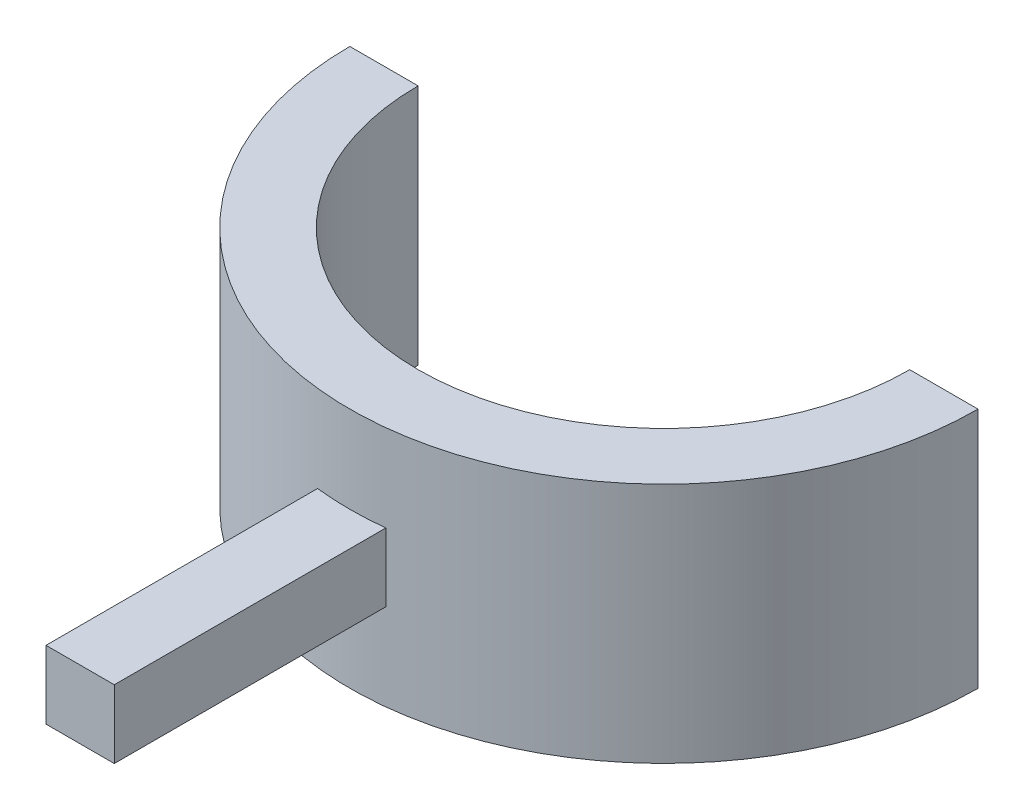
ISO-10303-21;
HEADER;
FILE_DESCRIPTION(('STEP AP214'),'2;1');
FILE_NAME('part.step','',(''),(''),'','','');
FILE_SCHEMA(('AUTOMOTIVE_DESIGN { 1 0 10303 214 1 1 1 1 }'));
ENDSEC;
DATA;
#1=APPLICATION_CONTEXT('core data for automotive mechanical design processes');
#2=APPLICATION_PROTOCOL_DEFINITION('international standard','automotive_design',2000,#1);
#3=PRODUCT_CONTEXT('',#1,'mechanical');
#4=PRODUCT('Part','Part','',(#3));
#5=PRODUCT_RELATED_PRODUCT_CATEGORY('part','',(#4));
#6=PRODUCT_DEFINITION_FORMATION('','',#4);
#7=PRODUCT_DEFINITION_CONTEXT('part definition',#1,'design');
#8=PRODUCT_DEFINITION('design','',#6,#7);
#9=PRODUCT_DEFINITION_SHAPE('','',#8);
#10=(LENGTH_UNIT() NAMED_UNIT(*) SI_UNIT(.MILLI.,.METRE.));
#11=(NAMED_UNIT(*) PLANE_ANGLE_UNIT() SI_UNIT($,.RADIAN.));
#12=(NAMED_UNIT(*) SI_UNIT($,.STERADIAN.) SOLID_ANGLE_UNIT());
#13=UNCERTAINTY_MEASURE_WITH_UNIT(LENGTH_MEASURE(1.E-05),#10,'distance_accuracy_value','');
#14=(GEOMETRIC_REPRESENTATION_CONTEXT(3) GLOBAL_UNCERTAINTY_ASSIGNED_CONTEXT((#13)) GLOBAL_UNIT_ASSIGNED_CONTEXT((#10,
#11,#12)) REPRESENTATION_CONTEXT('',''));
#15=CARTESIAN_POINT('',(0.,0.,0.));
#16=DIRECTION('',(0.,0.,1.));
#17=DIRECTION('',(1.,0.,0.));
#18=AXIS2_PLACEMENT_3D('',#15,#16,#17);
#19=CARTESIAN_POINT('',(2.5,6.355,19.75));
#20=DIRECTION('',(-1.,0.,0.));
#21=DIRECTION('',(0.,0.,1.));
#22=AXIS2_PLACEMENT_3D('',#19,#20,#21);
#23=PLANE('',#22);
#24=DIRECTION('',(0.,0.,-1.));
#25=VECTOR('',#24,1.);
#26=CARTESIAN_POINT('',(2.5,6.355,19.75));
#27=LINE('',#26,#25);
#28=CARTESIAN_POINT('',(2.5,6.355,19.75));
#29=VERTEX_POINT('',#28);
#30=CARTESIAN_POINT('',(2.5,6.355,-0.136273269652647));
#31=VERTEX_POINT('',#30);
#32=EDGE_CURVE('E105',#29,#31,#27,.T.);
#33=ORIENTED_EDGE('',*,*,#32,.T.);
#34=DIRECTION('',(0.,-1.,0.));
#35=VECTOR('',#34,1.);
#36=CARTESIAN_POINT('',(2.5,17.71,-0.136273269652647));
#37=LINE('',#36,#35);
#38=CARTESIAN_POINT('',(2.5,11.355,-0.136273269652647));
#39=VERTEX_POINT('',#38);
#40=EDGE_CURVE('E101',#31,#39,#37,.F.);
#41=ORIENTED_EDGE('',*,*,#40,.T.);
#42=DIRECTION('',(0.,0.,-1.));
#43=VECTOR('',#42,1.);
#44=CARTESIAN_POINT('',(2.5,11.355,19.75));
#45=LINE('',#44,#43);
#46=CARTESIAN_POINT('',(2.5,11.355,19.75));
#47=VERTEX_POINT('',#46);
#48=EDGE_CURVE('E12',#47,#39,#45,.T.);
#49=ORIENTED_EDGE('',*,*,#48,.F.);
#50=DIRECTION('',(0.,1.,0.));
#51=VECTOR('',#50,1.);
#52=CARTESIAN_POINT('',(2.5,6.355,19.75));
#53=LINE('',#52,#51);
#54=EDGE_CURVE('E111',#29,#47,#53,.T.);
#55=ORIENTED_EDGE('',*,*,#54,.F.);
#56=EDGE_LOOP('',(#33,#41,#49,#55));
#57=FACE_BOUND('',#56,.T.);
#58=ADVANCED_FACE('F49',(#57),#23,.F.);
#59=CARTESIAN_POINT('',(-2.5,11.355,19.75));
#60=DIRECTION('',(0.,-1.,0.));
#61=DIRECTION('',(0.,0.,-1.));
#62=AXIS2_PLACEMENT_3D('',#59,#60,#61);
#63=PLANE('',#62);
#64=ORIENTED_EDGE('',*,*,#48,.T.);
#65=CARTESIAN_POINT('',(0.,11.355,-23.));
#66=DIRECTION('',(0.,1.,0.));
#67=DIRECTION('',(0.,0.,1.));
#68=AXIS2_PLACEMENT_3D('',#65,#66,#67);
#69=CIRCLE('',#68,23.);
#70=CARTESIAN_POINT('',(-2.5,11.355,-0.13627326965265));
#71=VERTEX_POINT('',#70);
#72=EDGE_CURVE('E91',#39,#71,#69,.F.);
#73=ORIENTED_EDGE('',*,*,#72,.T.);
#74=DIRECTION('',(0.,0.,-1.));
#75=VECTOR('',#74,1.);
#76=CARTESIAN_POINT('',(-2.5,11.355,19.75));
#77=LINE('',#76,#75);
#78=CARTESIAN_POINT('',(-2.5,11.355,19.75));
#79=VERTEX_POINT('',#78);
#80=EDGE_CURVE('E56',#79,#71,#77,.T.);
#81=ORIENTED_EDGE('',*,*,#80,.F.);
#82=DIRECTION('',(-1.,0.,0.));
#83=VECTOR('',#82,1.);
#84=CARTESIAN_POINT('',(-2.5,11.355,19.75));
#85=LINE('',#84,#83);
#86=EDGE_CURVE('E92',#47,#79,#85,.T.);
#87=ORIENTED_EDGE('',*,*,#86,.F.);
#88=EDGE_LOOP('',(#64,#73,#81,#87));
#89=FACE_BOUND('',#88,.T.);
#90=ADVANCED_FACE('F89',(#89),#63,.F.);
#91=CARTESIAN_POINT('',(-2.5,6.355,19.75));
#92=DIRECTION('',(1.,0.,0.));
#93=DIRECTION('',(0.,0.,-1.));
#94=AXIS2_PLACEMENT_3D('',#91,#92,#93);
#95=PLANE('',#94);
#96=ORIENTED_EDGE('',*,*,#80,.T.);
#97=DIRECTION('',(0.,-1.,0.));
#98=VECTOR('',#97,1.);
#99=CARTESIAN_POINT('',(-2.5,17.71,-0.13627326965265));
#100=LINE('',#99,#98);
#101=CARTESIAN_POINT('',(-2.5,6.355,-0.13627326965265));
#102=VERTEX_POINT('',#101);
#103=EDGE_CURVE('E103',#71,#102,#100,.T.);
#104=ORIENTED_EDGE('',*,*,#103,.T.);
#105=DIRECTION('',(0.,0.,-1.));
#106=VECTOR('',#105,1.);
#107=CARTESIAN_POINT('',(-2.5,6.355,19.75));
#108=LINE('',#107,#106);
#109=CARTESIAN_POINT('',(-2.5,6.355,19.75));
#110=VERTEX_POINT('',#109);
#111=EDGE_CURVE('E118',#110,#102,#108,.T.);
#112=ORIENTED_EDGE('',*,*,#111,.F.);
#113=DIRECTION('',(0.,-1.,0.));
#114=VECTOR('',#113,1.);
#115=CARTESIAN_POINT('',(-2.5,6.355,19.75));
#116=LINE('',#115,#114);
#117=EDGE_CURVE('E68',#79,#110,#116,.T.);
#118=ORIENTED_EDGE('',*,*,#117,.F.);
#119=EDGE_LOOP('',(#96,#104,#112,#118));
#120=FACE_BOUND('',#119,.T.);
#121=ADVANCED_FACE('F120',(#120),#95,.F.);
#122=CARTESIAN_POINT('',(-2.5,6.355,19.75));
#123=DIRECTION('',(0.,1.,0.));
#124=DIRECTION('',(0.,0.,1.));
#125=AXIS2_PLACEMENT_3D('',#122,#123,#124);
#126=PLANE('',#125);
#127=ORIENTED_EDGE('',*,*,#111,.T.);
#128=CARTESIAN_POINT('',(0.,6.355,-23.));
#129=DIRECTION('',(0.,-1.,0.));
#130=DIRECTION('',(0.,0.,-1.));
#131=AXIS2_PLACEMENT_3D('',#128,#129,#130);
#132=CIRCLE('',#131,23.);
#133=EDGE_CURVE('E109',#102,#31,#132,.F.);
#134=ORIENTED_EDGE('',*,*,#133,.T.);
#135=ORIENTED_EDGE('',*,*,#32,.F.);
#136=DIRECTION('',(1.,0.,0.));
#137=VECTOR('',#136,1.);
#138=CARTESIAN_POINT('',(-2.5,6.355,19.75));
#139=LINE('',#138,#137);
#140=EDGE_CURVE('E63',#110,#29,#139,.T.);
#141=ORIENTED_EDGE('',*,*,#140,.F.);
#142=EDGE_LOOP('',(#127,#134,#135,#141));
#143=FACE_BOUND('',#142,.T.);
#144=ADVANCED_FACE('F122',(#143),#126,.F.);
#145=CARTESIAN_POINT('',(0.,0.,19.75));
#146=DIRECTION('',(0.,0.,-1.));
#147=DIRECTION('',(-1.,0.,0.));
#148=AXIS2_PLACEMENT_3D('',#145,#146,#147);
#149=PLANE('',#148);
#150=ORIENTED_EDGE('',*,*,#54,.T.);
#151=ORIENTED_EDGE('',*,*,#86,.T.);
#152=ORIENTED_EDGE('',*,*,#117,.T.);
#153=ORIENTED_EDGE('',*,*,#140,.T.);
#154=EDGE_LOOP('',(#150,#151,#152,#153));
#155=FACE_BOUND('',#154,.T.);
#156=ADVANCED_FACE('F123',(#155),#149,.F.);
#157=CARTESIAN_POINT('',(0.,17.71,-23.));
#158=DIRECTION('',(0.,-1.,0.));
#159=DIRECTION('',(0.,0.,-1.));
#160=AXIS2_PLACEMENT_3D('',#157,#158,#159);
#161=CYLINDRICAL_SURFACE('',#160,23.);
#162=ORIENTED_EDGE('',*,*,#103,.F.);
#163=ORIENTED_EDGE('',*,*,#72,.F.);
#164=ORIENTED_EDGE('',*,*,#40,.F.);
#165=ORIENTED_EDGE('',*,*,#133,.F.);
#166=EDGE_LOOP('',(#162,#163,#164,#165));
#167=FACE_BOUND('',#166,.T.);
#168=ADVANCED_FACE('F99',(#167),#161,.F.);
#169=CLOSED_SHELL('',(#58,#90,#121,#144,#156,#168));
#170=MANIFOLD_SOLID_BREP('B2',#169);
#171=CARTESIAN_POINT('',(0.,17.71,-23.));
#172=DIRECTION('',(0.,-1.,0.));
#173=DIRECTION('',(0.,0.,-1.));
#174=AXIS2_PLACEMENT_3D('',#171,#172,#173);
#175=CYLINDRICAL_SURFACE('',#174,18.);
#176=CARTESIAN_POINT('',(0.,0.,-23.));
#177=DIRECTION('',(0.,-1.,0.));
#178=DIRECTION('',(0.,0.,1.));
#179=AXIS2_PLACEMENT_3D('',#176,#177,#178);
#180=CIRCLE('',#179,18.);
#181=CARTESIAN_POINT('',(18.,0.,-23.));
#182=VERTEX_POINT('',#181);
#183=CARTESIAN_POINT('',(-18.,0.,-23.));
#184=VERTEX_POINT('',#183);
#185=EDGE_CURVE('E244',#182,#184,#180,.T.);
#186=ORIENTED_EDGE('',*,*,#185,.T.);
#187=DIRECTION('',(0.,-1.,0.));
#188=VECTOR('',#187,1.);
#189=CARTESIAN_POINT('',(-18.,17.71,-23.));
#190=LINE('',#189,#188);
#191=CARTESIAN_POINT('',(-18.,17.71,-23.));
#192=VERTEX_POINT('',#191);
#193=EDGE_CURVE('E47',#192,#184,#190,.T.);
#194=ORIENTED_EDGE('',*,*,#193,.F.);
#195=CARTESIAN_POINT('',(0.,17.71,-23.));
#196=DIRECTION('',(0.,-1.,0.));
#197=DIRECTION('',(0.,0.,1.));
#198=AXIS2_PLACEMENT_3D('',#195,#196,#197);
#199=CIRCLE('',#198,18.);
#200=CARTESIAN_POINT('',(18.,17.71,-23.));
#201=VERTEX_POINT('',#200);
#202=EDGE_CURVE('E228',#201,#192,#199,.T.);
#203=ORIENTED_EDGE('',*,*,#202,.F.);
#204=DIRECTION('',(0.,-1.,0.));
#205=VECTOR('',#204,1.);
#206=CARTESIAN_POINT('',(18.,17.71,-23.));
#207=LINE('',#206,#205);
#208=EDGE_CURVE('E240',#201,#182,#207,.T.);
#209=ORIENTED_EDGE('',*,*,#208,.T.);
#210=EDGE_LOOP('',(#186,#194,#203,#209));
#211=FACE_BOUND('',#210,.T.);
#212=ADVANCED_FACE('F176',(#211),#175,.F.);
#213=CARTESIAN_POINT('',(-18.,17.71,-23.));
#214=DIRECTION('',(0.,0.,1.));
#215=DIRECTION('',(1.,0.,0.));
#216=AXIS2_PLACEMENT_3D('',#213,#214,#215);
#217=PLANE('',#216);
#218=DIRECTION('',(-1.,0.,0.));
#219=VECTOR('',#218,1.);
#220=CARTESIAN_POINT('',(-18.,0.,-23.));
#221=LINE('',#220,#219);
#222=CARTESIAN_POINT('',(-23.,0.,-23.));
#223=VERTEX_POINT('',#222);
#224=EDGE_CURVE('E233',#184,#223,#221,.T.);
#225=ORIENTED_EDGE('',*,*,#224,.T.);
#226=DIRECTION('',(0.,-1.,0.));
#227=VECTOR('',#226,1.);
#228=CARTESIAN_POINT('',(-23.,17.71,-23.));
#229=LINE('',#228,#227);
#230=CARTESIAN_POINT('',(-23.,17.71,-23.));
#231=VERTEX_POINT('',#230);
#232=EDGE_CURVE('E185',#231,#223,#229,.T.);
#233=ORIENTED_EDGE('',*,*,#232,.F.);
#234=DIRECTION('',(-1.,0.,0.));
#235=VECTOR('',#234,1.);
#236=CARTESIAN_POINT('',(-18.,17.71,-23.));
#237=LINE('',#236,#235);
#238=EDGE_CURVE('E223',#192,#231,#237,.T.);
#239=ORIENTED_EDGE('',*,*,#238,.F.);
#240=ORIENTED_EDGE('',*,*,#193,.T.);
#241=EDGE_LOOP('',(#225,#233,#239,#240));
#242=FACE_BOUND('',#241,.T.);
#243=ADVANCED_FACE('F232',(#242),#217,.F.);
#244=CARTESIAN_POINT('',(0.,17.71,-23.));
#245=DIRECTION('',(0.,-1.,0.));
#246=DIRECTION('',(0.,0.,-1.));
#247=AXIS2_PLACEMENT_3D('',#244,#245,#246);
#248=CYLINDRICAL_SURFACE('',#247,23.);
#249=CARTESIAN_POINT('',(0.,0.,-23.));
#250=DIRECTION('',(0.,1.,0.));
#251=DIRECTION('',(0.,0.,1.));
#252=AXIS2_PLACEMENT_3D('',#249,#250,#251);
#253=CIRCLE('',#252,23.);
#254=CARTESIAN_POINT('',(23.,0.,-23.));
#255=VERTEX_POINT('',#254);
#256=EDGE_CURVE('E210',#223,#255,#253,.T.);
#257=ORIENTED_EDGE('',*,*,#256,.T.);
#258=DIRECTION('',(0.,-1.,0.));
#259=VECTOR('',#258,1.);
#260=CARTESIAN_POINT('',(23.,17.71,-23.));
#261=LINE('',#260,#259);
#262=CARTESIAN_POINT('',(23.,17.71,-23.));
#263=VERTEX_POINT('',#262);
#264=EDGE_CURVE('E235',#263,#255,#261,.T.);
#265=ORIENTED_EDGE('',*,*,#264,.F.);
#266=CARTESIAN_POINT('',(0.,17.71,-23.));
#267=DIRECTION('',(0.,1.,0.));
#268=DIRECTION('',(0.,0.,1.));
#269=AXIS2_PLACEMENT_3D('',#266,#267,#268);
#270=CIRCLE('',#269,23.);
#271=EDGE_CURVE('E226',#231,#263,#270,.T.);
#272=ORIENTED_EDGE('',*,*,#271,.F.);
#273=ORIENTED_EDGE('',*,*,#232,.T.);
#274=EDGE_LOOP('',(#257,#265,#272,#273));
#275=FACE_BOUND('',#274,.T.);
#276=ADVANCED_FACE('F236',(#275),#248,.T.);
#277=CARTESIAN_POINT('',(23.,17.71,-23.));
#278=DIRECTION('',(0.,0.,1.));
#279=DIRECTION('',(1.,0.,0.));
#280=AXIS2_PLACEMENT_3D('',#277,#278,#279);
#281=PLANE('',#280);
#282=DIRECTION('',(-1.,0.,0.));
#283=VECTOR('',#282,1.);
#284=CARTESIAN_POINT('',(23.,0.,-23.));
#285=LINE('',#284,#283);
#286=EDGE_CURVE('E216',#255,#182,#285,.T.);
#287=ORIENTED_EDGE('',*,*,#286,.T.);
#288=ORIENTED_EDGE('',*,*,#208,.F.);
#289=DIRECTION('',(-1.,0.,0.));
#290=VECTOR('',#289,1.);
#291=CARTESIAN_POINT('',(23.,17.71,-23.));
#292=LINE('',#291,#290);
#293=EDGE_CURVE('E193',#263,#201,#292,.T.);
#294=ORIENTED_EDGE('',*,*,#293,.F.);
#295=ORIENTED_EDGE('',*,*,#264,.T.);
#296=EDGE_LOOP('',(#287,#288,#294,#295));
#297=FACE_BOUND('',#296,.T.);
#298=ADVANCED_FACE('F257',(#297),#281,.F.);
#299=CARTESIAN_POINT('',(0.,17.71,-23.));
#300=DIRECTION('',(0.,1.,0.));
#301=DIRECTION('',(0.,0.,1.));
#302=AXIS2_PLACEMENT_3D('',#299,#300,#301);
#303=PLANE('',#302);
#304=ORIENTED_EDGE('',*,*,#202,.T.);
#305=ORIENTED_EDGE('',*,*,#238,.T.);
#306=ORIENTED_EDGE('',*,*,#271,.T.);
#307=ORIENTED_EDGE('',*,*,#293,.T.);
#308=EDGE_LOOP('',(#304,#305,#306,#307));
#309=FACE_BOUND('',#308,.T.);
#310=ADVANCED_FACE('F224',(#309),#303,.T.);
#311=CARTESIAN_POINT('',(0.,0.,-23.));
#312=DIRECTION('',(0.,1.,0.));
#313=DIRECTION('',(0.,0.,1.));
#314=AXIS2_PLACEMENT_3D('',#311,#312,#313);
#315=PLANE('',#314);
#316=ORIENTED_EDGE('',*,*,#185,.F.);
#317=ORIENTED_EDGE('',*,*,#286,.F.);
#318=ORIENTED_EDGE('',*,*,#256,.F.);
#319=ORIENTED_EDGE('',*,*,#224,.F.);
#320=EDGE_LOOP('',(#316,#317,#318,#319));
#321=FACE_BOUND('',#320,.T.);
#322=ADVANCED_FACE('F260',(#321),#315,.F.);
#323=CLOSED_SHELL('',(#212,#243,#276,#298,#310,#322));
#324=MANIFOLD_SOLID_BREP('B6',#323);
#325=ADVANCED_BREP_SHAPE_REPRESENTATION('',(#18,#170,#324),#14);
#326=SHAPE_DEFINITION_REPRESENTATION(#9,#325);
ENDSEC;
END-ISO-10303-21;
